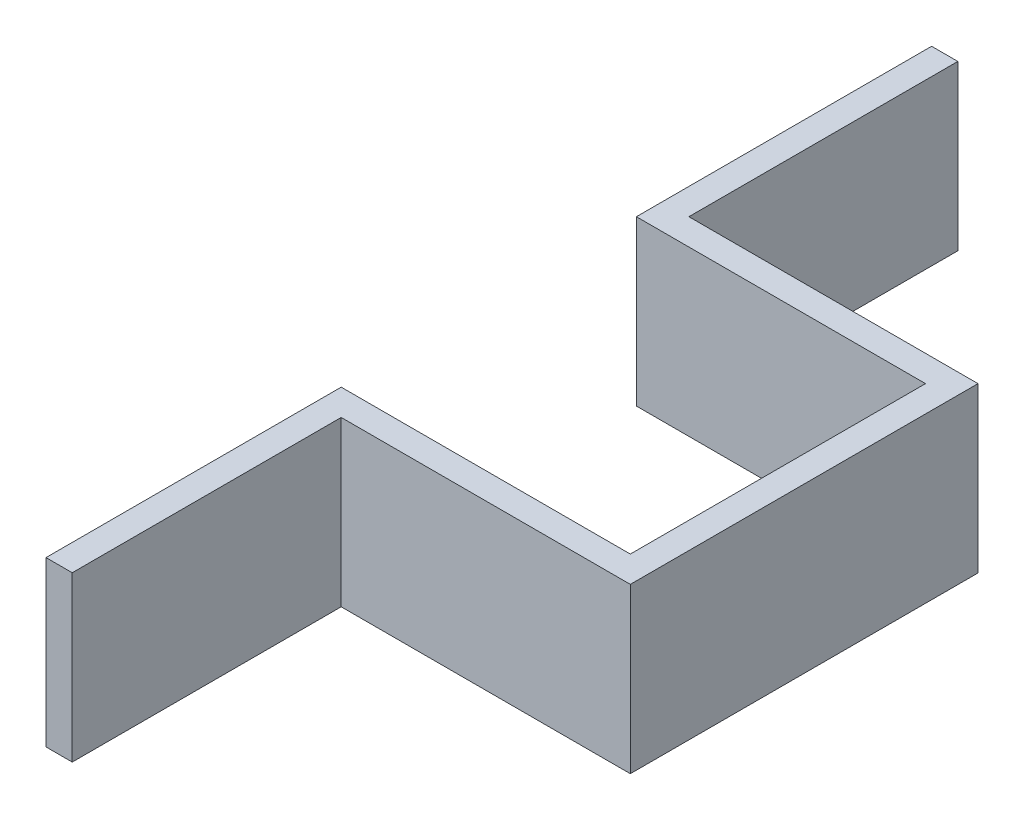
ISO-10303-21;
HEADER;
FILE_DESCRIPTION(('STEP AP214'),'2;1');
FILE_NAME('part.step','',(''),(''),'','','');
FILE_SCHEMA(('AUTOMOTIVE_DESIGN { 1 0 10303 214 1 1 1 1 }'));
ENDSEC;
DATA;
#1=APPLICATION_CONTEXT('core data for automotive mechanical design processes');
#2=APPLICATION_PROTOCOL_DEFINITION('international standard','automotive_design',2000,#1);
#3=PRODUCT_CONTEXT('',#1,'mechanical');
#4=PRODUCT('Part','Part','',(#3));
#5=PRODUCT_RELATED_PRODUCT_CATEGORY('part','',(#4));
#6=PRODUCT_DEFINITION_FORMATION('','',#4);
#7=PRODUCT_DEFINITION_CONTEXT('part definition',#1,'design');
#8=PRODUCT_DEFINITION('design','',#6,#7);
#9=PRODUCT_DEFINITION_SHAPE('','',#8);
#10=(LENGTH_UNIT() NAMED_UNIT(*) SI_UNIT(.MILLI.,.METRE.));
#11=(NAMED_UNIT(*) PLANE_ANGLE_UNIT() SI_UNIT($,.RADIAN.));
#12=(NAMED_UNIT(*) SI_UNIT($,.STERADIAN.) SOLID_ANGLE_UNIT());
#13=UNCERTAINTY_MEASURE_WITH_UNIT(LENGTH_MEASURE(1.E-05),#10,'distance_accuracy_value','');
#14=(GEOMETRIC_REPRESENTATION_CONTEXT(3) GLOBAL_UNCERTAINTY_ASSIGNED_CONTEXT((#13)) GLOBAL_UNIT_ASSIGNED_CONTEXT((#10,
#11,#12)) REPRESENTATION_CONTEXT('',''));
#15=CARTESIAN_POINT('',(0.,0.,0.));
#16=DIRECTION('',(0.,0.,1.));
#17=DIRECTION('',(1.,0.,0.));
#18=AXIS2_PLACEMENT_3D('',#15,#16,#17);
#19=CARTESIAN_POINT('',(194.102258894867,-20.,-261.5));
#20=DIRECTION('',(1.,0.,0.));
#21=DIRECTION('',(0.,0.,-1.));
#22=AXIS2_PLACEMENT_3D('',#19,#20,#21);
#23=PLANE('',#22);
#24=DIRECTION('',(0.,0.,-1.));
#25=VECTOR('',#24,1.);
#26=CARTESIAN_POINT('',(194.102258894867,5.,-261.5));
#27=LINE('',#26,#25);
#28=CARTESIAN_POINT('',(194.102258894867,5.,-261.5));
#29=VERTEX_POINT('',#28);
#30=CARTESIAN_POINT('',(194.102258894867,5.,-302.5));
#31=VERTEX_POINT('',#30);
#32=EDGE_CURVE('E154',#29,#31,#27,.T.);
#33=ORIENTED_EDGE('',*,*,#32,.F.);
#34=DIRECTION('',(0.,1.,0.));
#35=VECTOR('',#34,1.);
#36=CARTESIAN_POINT('',(194.102258894867,-20.,-261.5));
#37=LINE('',#36,#35);
#38=CARTESIAN_POINT('',(194.102258894867,-20.,-261.5));
#39=VERTEX_POINT('',#38);
#40=EDGE_CURVE('E11',#39,#29,#37,.T.);
#41=ORIENTED_EDGE('',*,*,#40,.F.);
#42=DIRECTION('',(0.,0.,-1.));
#43=VECTOR('',#42,1.);
#44=CARTESIAN_POINT('',(194.102258894867,-20.,-261.5));
#45=LINE('',#44,#43);
#46=CARTESIAN_POINT('',(194.102258894867,-20.,-302.5));
#47=VERTEX_POINT('',#46);
#48=EDGE_CURVE('E186',#39,#47,#45,.T.);
#49=ORIENTED_EDGE('',*,*,#48,.T.);
#50=DIRECTION('',(0.,1.,0.));
#51=VECTOR('',#50,1.);
#52=CARTESIAN_POINT('',(194.102258894867,-20.,-302.5));
#53=LINE('',#52,#51);
#54=EDGE_CURVE('E36',#47,#31,#53,.T.);
#55=ORIENTED_EDGE('',*,*,#54,.T.);
#56=EDGE_LOOP('',(#33,#41,#49,#55));
#57=FACE_BOUND('',#56,.T.);
#58=ADVANCED_FACE('F33',(#57),#23,.T.);
#59=CARTESIAN_POINT('',(238.174494692057,-20.,-261.5));
#60=DIRECTION('',(0.,0.,-1.));
#61=DIRECTION('',(-1.,0.,0.));
#62=AXIS2_PLACEMENT_3D('',#59,#60,#61);
#63=PLANE('',#62);
#64=DIRECTION('',(-1.,0.,0.));
#65=VECTOR('',#64,1.);
#66=CARTESIAN_POINT('',(238.174494692057,5.,-261.5));
#67=LINE('',#66,#65);
#68=CARTESIAN_POINT('',(238.174494692057,5.,-261.5));
#69=VERTEX_POINT('',#68);
#70=EDGE_CURVE('E184',#69,#29,#67,.T.);
#71=ORIENTED_EDGE('',*,*,#70,.F.);
#72=DIRECTION('',(0.,1.,0.));
#73=VECTOR('',#72,1.);
#74=CARTESIAN_POINT('',(238.174494692057,-20.,-261.5));
#75=LINE('',#74,#73);
#76=CARTESIAN_POINT('',(238.174494692057,-20.,-261.5));
#77=VERTEX_POINT('',#76);
#78=EDGE_CURVE('E42',#77,#69,#75,.T.);
#79=ORIENTED_EDGE('',*,*,#78,.F.);
#80=DIRECTION('',(-1.,0.,0.));
#81=VECTOR('',#80,1.);
#82=CARTESIAN_POINT('',(238.174494692057,-20.,-261.5));
#83=LINE('',#82,#81);
#84=EDGE_CURVE('E144',#77,#39,#83,.T.);
#85=ORIENTED_EDGE('',*,*,#84,.T.);
#86=ORIENTED_EDGE('',*,*,#40,.T.);
#87=EDGE_LOOP('',(#71,#79,#85,#86));
#88=FACE_BOUND('',#87,.T.);
#89=ADVANCED_FACE('F206',(#88),#63,.T.);
#90=CARTESIAN_POINT('',(238.174494692057,-20.,-208.5));
#91=DIRECTION('',(1.,0.,0.));
#92=DIRECTION('',(0.,0.,-1.));
#93=AXIS2_PLACEMENT_3D('',#90,#91,#92);
#94=PLANE('',#93);
#95=DIRECTION('',(0.,0.,-1.));
#96=VECTOR('',#95,1.);
#97=CARTESIAN_POINT('',(238.174494692057,5.,-208.5));
#98=LINE('',#97,#96);
#99=CARTESIAN_POINT('',(238.174494692057,5.,-208.5));
#100=VERTEX_POINT('',#99);
#101=EDGE_CURVE('E131',#100,#69,#98,.T.);
#102=ORIENTED_EDGE('',*,*,#101,.F.);
#103=DIRECTION('',(0.,1.,0.));
#104=VECTOR('',#103,1.);
#105=CARTESIAN_POINT('',(238.174494692057,-20.,-208.5));
#106=LINE('',#105,#104);
#107=CARTESIAN_POINT('',(238.174494692057,-20.,-208.5));
#108=VERTEX_POINT('',#107);
#109=EDGE_CURVE('E126',#108,#100,#106,.T.);
#110=ORIENTED_EDGE('',*,*,#109,.F.);
#111=DIRECTION('',(0.,0.,-1.));
#112=VECTOR('',#111,1.);
#113=CARTESIAN_POINT('',(238.174494692057,-20.,-208.5));
#114=LINE('',#113,#112);
#115=EDGE_CURVE('E129',#108,#77,#114,.T.);
#116=ORIENTED_EDGE('',*,*,#115,.T.);
#117=ORIENTED_EDGE('',*,*,#78,.T.);
#118=EDGE_LOOP('',(#102,#110,#116,#117));
#119=FACE_BOUND('',#118,.T.);
#120=ADVANCED_FACE('F128',(#119),#94,.T.);
#121=CARTESIAN_POINT('',(194.102258894867,-20.,-208.5));
#122=DIRECTION('',(0.,0.,1.));
#123=DIRECTION('',(1.,0.,0.));
#124=AXIS2_PLACEMENT_3D('',#121,#122,#123);
#125=PLANE('',#124);
#126=DIRECTION('',(1.,0.,0.));
#127=VECTOR('',#126,1.);
#128=CARTESIAN_POINT('',(194.102258894867,5.,-208.5));
#129=LINE('',#128,#127);
#130=CARTESIAN_POINT('',(194.102258894867,5.,-208.5));
#131=VERTEX_POINT('',#130);
#132=EDGE_CURVE('E181',#131,#100,#129,.T.);
#133=ORIENTED_EDGE('',*,*,#132,.F.);
#134=DIRECTION('',(0.,1.,0.));
#135=VECTOR('',#134,1.);
#136=CARTESIAN_POINT('',(194.102258894867,-20.,-208.5));
#137=LINE('',#136,#135);
#138=CARTESIAN_POINT('',(194.102258894867,-20.,-208.5));
#139=VERTEX_POINT('',#138);
#140=EDGE_CURVE('E136',#139,#131,#137,.T.);
#141=ORIENTED_EDGE('',*,*,#140,.F.);
#142=DIRECTION('',(1.,0.,0.));
#143=VECTOR('',#142,1.);
#144=CARTESIAN_POINT('',(194.102258894867,-20.,-208.5));
#145=LINE('',#144,#143);
#146=EDGE_CURVE('E142',#139,#108,#145,.T.);
#147=ORIENTED_EDGE('',*,*,#146,.T.);
#148=ORIENTED_EDGE('',*,*,#109,.T.);
#149=EDGE_LOOP('',(#133,#141,#147,#148));
#150=FACE_BOUND('',#149,.T.);
#151=ADVANCED_FACE('F146',(#150),#125,.T.);
#152=CARTESIAN_POINT('',(194.102258894867,-20.,-167.5));
#153=DIRECTION('',(1.,0.,0.));
#154=DIRECTION('',(0.,0.,-1.));
#155=AXIS2_PLACEMENT_3D('',#152,#153,#154);
#156=PLANE('',#155);
#157=DIRECTION('',(0.,0.,-1.));
#158=VECTOR('',#157,1.);
#159=CARTESIAN_POINT('',(194.102258894867,5.,-167.5));
#160=LINE('',#159,#158);
#161=CARTESIAN_POINT('',(194.102258894867,5.,-167.5));
#162=VERTEX_POINT('',#161);
#163=EDGE_CURVE('E178',#162,#131,#160,.T.);
#164=ORIENTED_EDGE('',*,*,#163,.F.);
#165=DIRECTION('',(0.,1.,0.));
#166=VECTOR('',#165,1.);
#167=CARTESIAN_POINT('',(194.102258894867,-20.,-167.5));
#168=LINE('',#167,#166);
#169=CARTESIAN_POINT('',(194.102258894867,-20.,-167.5));
#170=VERTEX_POINT('',#169);
#171=EDGE_CURVE('E190',#170,#162,#168,.T.);
#172=ORIENTED_EDGE('',*,*,#171,.F.);
#173=DIRECTION('',(0.,0.,-1.));
#174=VECTOR('',#173,1.);
#175=CARTESIAN_POINT('',(194.102258894867,-20.,-167.5));
#176=LINE('',#175,#174);
#177=EDGE_CURVE('E147',#170,#139,#176,.T.);
#178=ORIENTED_EDGE('',*,*,#177,.T.);
#179=ORIENTED_EDGE('',*,*,#140,.T.);
#180=EDGE_LOOP('',(#164,#172,#178,#179));
#181=FACE_BOUND('',#180,.T.);
#182=ADVANCED_FACE('F219',(#181),#156,.T.);
#183=CARTESIAN_POINT('',(190.102258894867,-20.,-167.5));
#184=DIRECTION('',(0.,0.,1.));
#185=DIRECTION('',(1.,0.,0.));
#186=AXIS2_PLACEMENT_3D('',#183,#184,#185);
#187=PLANE('',#186);
#188=DIRECTION('',(1.,0.,0.));
#189=VECTOR('',#188,1.);
#190=CARTESIAN_POINT('',(190.102258894867,5.,-167.5));
#191=LINE('',#190,#189);
#192=CARTESIAN_POINT('',(190.102258894867,5.,-167.5));
#193=VERTEX_POINT('',#192);
#194=EDGE_CURVE('E175',#193,#162,#191,.T.);
#195=ORIENTED_EDGE('',*,*,#194,.F.);
#196=DIRECTION('',(0.,1.,0.));
#197=VECTOR('',#196,1.);
#198=CARTESIAN_POINT('',(190.102258894867,-20.,-167.5));
#199=LINE('',#198,#197);
#200=CARTESIAN_POINT('',(190.102258894867,-20.,-167.5));
#201=VERTEX_POINT('',#200);
#202=EDGE_CURVE('E192',#201,#193,#199,.T.);
#203=ORIENTED_EDGE('',*,*,#202,.F.);
#204=DIRECTION('',(1.,0.,0.));
#205=VECTOR('',#204,1.);
#206=CARTESIAN_POINT('',(190.102258894867,-20.,-167.5));
#207=LINE('',#206,#205);
#208=EDGE_CURVE('E149',#201,#170,#207,.T.);
#209=ORIENTED_EDGE('',*,*,#208,.T.);
#210=ORIENTED_EDGE('',*,*,#171,.T.);
#211=EDGE_LOOP('',(#195,#203,#209,#210));
#212=FACE_BOUND('',#211,.T.);
#213=ADVANCED_FACE('F222',(#212),#187,.T.);
#214=CARTESIAN_POINT('',(190.102258894867,-20.,-212.5));
#215=DIRECTION('',(-1.,0.,0.));
#216=DIRECTION('',(0.,0.,1.));
#217=AXIS2_PLACEMENT_3D('',#214,#215,#216);
#218=PLANE('',#217);
#219=DIRECTION('',(0.,0.,1.));
#220=VECTOR('',#219,1.);
#221=CARTESIAN_POINT('',(190.102258894867,5.,-212.5));
#222=LINE('',#221,#220);
#223=CARTESIAN_POINT('',(190.102258894867,5.,-212.5));
#224=VERTEX_POINT('',#223);
#225=EDGE_CURVE('E172',#224,#193,#222,.T.);
#226=ORIENTED_EDGE('',*,*,#225,.F.);
#227=DIRECTION('',(0.,1.,0.));
#228=VECTOR('',#227,1.);
#229=CARTESIAN_POINT('',(190.102258894867,-20.,-212.5));
#230=LINE('',#229,#228);
#231=CARTESIAN_POINT('',(190.102258894867,-20.,-212.5));
#232=VERTEX_POINT('',#231);
#233=EDGE_CURVE('E194',#232,#224,#230,.T.);
#234=ORIENTED_EDGE('',*,*,#233,.F.);
#235=DIRECTION('',(0.,0.,1.));
#236=VECTOR('',#235,1.);
#237=CARTESIAN_POINT('',(190.102258894867,-20.,-212.5));
#238=LINE('',#237,#236);
#239=EDGE_CURVE('E348',#232,#201,#238,.T.);
#240=ORIENTED_EDGE('',*,*,#239,.T.);
#241=ORIENTED_EDGE('',*,*,#202,.T.);
#242=EDGE_LOOP('',(#226,#234,#240,#241));
#243=FACE_BOUND('',#242,.T.);
#244=ADVANCED_FACE('F226',(#243),#218,.T.);
#245=CARTESIAN_POINT('',(234.174494692057,-20.,-212.5));
#246=DIRECTION('',(0.,0.,-1.));
#247=DIRECTION('',(-1.,0.,0.));
#248=AXIS2_PLACEMENT_3D('',#245,#246,#247);
#249=PLANE('',#248);
#250=DIRECTION('',(-1.,0.,0.));
#251=VECTOR('',#250,1.);
#252=CARTESIAN_POINT('',(234.174494692057,5.,-212.5));
#253=LINE('',#252,#251);
#254=CARTESIAN_POINT('',(234.174494692057,5.,-212.5));
#255=VERTEX_POINT('',#254);
#256=EDGE_CURVE('E169',#255,#224,#253,.T.);
#257=ORIENTED_EDGE('',*,*,#256,.F.);
#258=DIRECTION('',(0.,1.,0.));
#259=VECTOR('',#258,1.);
#260=CARTESIAN_POINT('',(234.174494692057,-20.,-212.5));
#261=LINE('',#260,#259);
#262=CARTESIAN_POINT('',(234.174494692057,-20.,-212.5));
#263=VERTEX_POINT('',#262);
#264=EDGE_CURVE('E196',#263,#255,#261,.T.);
#265=ORIENTED_EDGE('',*,*,#264,.F.);
#266=DIRECTION('',(-1.,0.,0.));
#267=VECTOR('',#266,1.);
#268=CARTESIAN_POINT('',(234.174494692057,-20.,-212.5));
#269=LINE('',#268,#267);
#270=EDGE_CURVE('E352',#263,#232,#269,.T.);
#271=ORIENTED_EDGE('',*,*,#270,.T.);
#272=ORIENTED_EDGE('',*,*,#233,.T.);
#273=EDGE_LOOP('',(#257,#265,#271,#272));
#274=FACE_BOUND('',#273,.T.);
#275=ADVANCED_FACE('F230',(#274),#249,.T.);
#276=CARTESIAN_POINT('',(234.174494692057,-20.,-257.5));
#277=DIRECTION('',(-1.,0.,0.));
#278=DIRECTION('',(0.,0.,1.));
#279=AXIS2_PLACEMENT_3D('',#276,#277,#278);
#280=PLANE('',#279);
#281=DIRECTION('',(0.,0.,1.));
#282=VECTOR('',#281,1.);
#283=CARTESIAN_POINT('',(234.174494692057,5.,-257.5));
#284=LINE('',#283,#282);
#285=CARTESIAN_POINT('',(234.174494692057,5.,-257.5));
#286=VERTEX_POINT('',#285);
#287=EDGE_CURVE('E166',#286,#255,#284,.T.);
#288=ORIENTED_EDGE('',*,*,#287,.F.);
#289=DIRECTION('',(0.,1.,0.));
#290=VECTOR('',#289,1.);
#291=CARTESIAN_POINT('',(234.174494692057,-20.,-257.5));
#292=LINE('',#291,#290);
#293=CARTESIAN_POINT('',(234.174494692057,-20.,-257.5));
#294=VERTEX_POINT('',#293);
#295=EDGE_CURVE('E198',#294,#286,#292,.T.);
#296=ORIENTED_EDGE('',*,*,#295,.F.);
#297=DIRECTION('',(0.,0.,1.));
#298=VECTOR('',#297,1.);
#299=CARTESIAN_POINT('',(234.174494692057,-20.,-257.5));
#300=LINE('',#299,#298);
#301=EDGE_CURVE('E341',#294,#263,#300,.T.);
#302=ORIENTED_EDGE('',*,*,#301,.T.);
#303=ORIENTED_EDGE('',*,*,#264,.T.);
#304=EDGE_LOOP('',(#288,#296,#302,#303));
#305=FACE_BOUND('',#304,.T.);
#306=ADVANCED_FACE('F234',(#305),#280,.T.);
#307=CARTESIAN_POINT('',(190.102258894867,-20.,-257.5));
#308=DIRECTION('',(0.,0.,1.));
#309=DIRECTION('',(1.,0.,0.));
#310=AXIS2_PLACEMENT_3D('',#307,#308,#309);
#311=PLANE('',#310);
#312=DIRECTION('',(1.,0.,0.));
#313=VECTOR('',#312,1.);
#314=CARTESIAN_POINT('',(190.102258894867,5.,-257.5));
#315=LINE('',#314,#313);
#316=CARTESIAN_POINT('',(190.102258894867,5.,-257.5));
#317=VERTEX_POINT('',#316);
#318=EDGE_CURVE('E163',#317,#286,#315,.T.);
#319=ORIENTED_EDGE('',*,*,#318,.F.);
#320=DIRECTION('',(0.,1.,0.));
#321=VECTOR('',#320,1.);
#322=CARTESIAN_POINT('',(190.102258894867,-20.,-257.5));
#323=LINE('',#322,#321);
#324=CARTESIAN_POINT('',(190.102258894867,-20.,-257.5));
#325=VERTEX_POINT('',#324);
#326=EDGE_CURVE('E200',#325,#317,#323,.T.);
#327=ORIENTED_EDGE('',*,*,#326,.F.);
#328=DIRECTION('',(1.,0.,0.));
#329=VECTOR('',#328,1.);
#330=CARTESIAN_POINT('',(190.102258894867,-20.,-257.5));
#331=LINE('',#330,#329);
#332=EDGE_CURVE('E337',#325,#294,#331,.T.);
#333=ORIENTED_EDGE('',*,*,#332,.T.);
#334=ORIENTED_EDGE('',*,*,#295,.T.);
#335=EDGE_LOOP('',(#319,#327,#333,#334));
#336=FACE_BOUND('',#335,.T.);
#337=ADVANCED_FACE('F238',(#336),#311,.T.);
#338=CARTESIAN_POINT('',(190.102258894867,-20.,-302.5));
#339=DIRECTION('',(-1.,0.,0.));
#340=DIRECTION('',(0.,0.,1.));
#341=AXIS2_PLACEMENT_3D('',#338,#339,#340);
#342=PLANE('',#341);
#343=DIRECTION('',(0.,0.,1.));
#344=VECTOR('',#343,1.);
#345=CARTESIAN_POINT('',(190.102258894867,5.,-302.5));
#346=LINE('',#345,#344);
#347=CARTESIAN_POINT('',(190.102258894867,5.,-302.5));
#348=VERTEX_POINT('',#347);
#349=EDGE_CURVE('E160',#348,#317,#346,.T.);
#350=ORIENTED_EDGE('',*,*,#349,.F.);
#351=DIRECTION('',(0.,1.,0.));
#352=VECTOR('',#351,1.);
#353=CARTESIAN_POINT('',(190.102258894867,-20.,-302.5));
#354=LINE('',#353,#352);
#355=CARTESIAN_POINT('',(190.102258894867,-20.,-302.5));
#356=VERTEX_POINT('',#355);
#357=EDGE_CURVE('E201',#356,#348,#354,.T.);
#358=ORIENTED_EDGE('',*,*,#357,.F.);
#359=DIRECTION('',(0.,0.,1.));
#360=VECTOR('',#359,1.);
#361=CARTESIAN_POINT('',(190.102258894867,-20.,-302.5));
#362=LINE('',#361,#360);
#363=EDGE_CURVE('E358',#356,#325,#362,.T.);
#364=ORIENTED_EDGE('',*,*,#363,.T.);
#365=ORIENTED_EDGE('',*,*,#326,.T.);
#366=EDGE_LOOP('',(#350,#358,#364,#365));
#367=FACE_BOUND('',#366,.T.);
#368=ADVANCED_FACE('F242',(#367),#342,.T.);
#369=CARTESIAN_POINT('',(194.102258894867,-20.,-302.5));
#370=DIRECTION('',(0.,0.,-1.));
#371=DIRECTION('',(-1.,0.,0.));
#372=AXIS2_PLACEMENT_3D('',#369,#370,#371);
#373=PLANE('',#372);
#374=DIRECTION('',(-1.,0.,0.));
#375=VECTOR('',#374,1.);
#376=CARTESIAN_POINT('',(194.102258894867,5.,-302.5));
#377=LINE('',#376,#375);
#378=EDGE_CURVE('E157',#31,#348,#377,.T.);
#379=ORIENTED_EDGE('',*,*,#378,.F.);
#380=ORIENTED_EDGE('',*,*,#54,.F.);
#381=DIRECTION('',(-1.,0.,0.));
#382=VECTOR('',#381,1.);
#383=CARTESIAN_POINT('',(194.102258894867,-20.,-302.5));
#384=LINE('',#383,#382);
#385=EDGE_CURVE('E360',#47,#356,#384,.T.);
#386=ORIENTED_EDGE('',*,*,#385,.T.);
#387=ORIENTED_EDGE('',*,*,#357,.T.);
#388=EDGE_LOOP('',(#379,#380,#386,#387));
#389=FACE_BOUND('',#388,.T.);
#390=ADVANCED_FACE('F203',(#389),#373,.T.);
#391=CARTESIAN_POINT('',(0.,-20.,0.));
#392=DIRECTION('',(0.,1.,0.));
#393=DIRECTION('',(0.,0.,1.));
#394=AXIS2_PLACEMENT_3D('',#391,#392,#393);
#395=PLANE('',#394);
#396=ORIENTED_EDGE('',*,*,#48,.F.);
#397=ORIENTED_EDGE('',*,*,#84,.F.);
#398=ORIENTED_EDGE('',*,*,#115,.F.);
#399=ORIENTED_EDGE('',*,*,#146,.F.);
#400=ORIENTED_EDGE('',*,*,#177,.F.);
#401=ORIENTED_EDGE('',*,*,#208,.F.);
#402=ORIENTED_EDGE('',*,*,#239,.F.);
#403=ORIENTED_EDGE('',*,*,#270,.F.);
#404=ORIENTED_EDGE('',*,*,#301,.F.);
#405=ORIENTED_EDGE('',*,*,#332,.F.);
#406=ORIENTED_EDGE('',*,*,#363,.F.);
#407=ORIENTED_EDGE('',*,*,#385,.F.);
#408=EDGE_LOOP('',(#396,#397,#398,#399,#400,#401,#402,#403,#404,#405,#406,#407));
#409=FACE_BOUND('',#408,.T.);
#410=ADVANCED_FACE('F140',(#409),#395,.F.);
#411=CARTESIAN_POINT('',(0.,5.,0.));
#412=DIRECTION('',(0.,1.,0.));
#413=DIRECTION('',(0.,0.,1.));
#414=AXIS2_PLACEMENT_3D('',#411,#412,#413);
#415=PLANE('',#414);
#416=ORIENTED_EDGE('',*,*,#32,.T.);
#417=ORIENTED_EDGE('',*,*,#378,.T.);
#418=ORIENTED_EDGE('',*,*,#349,.T.);
#419=ORIENTED_EDGE('',*,*,#318,.T.);
#420=ORIENTED_EDGE('',*,*,#287,.T.);
#421=ORIENTED_EDGE('',*,*,#256,.T.);
#422=ORIENTED_EDGE('',*,*,#225,.T.);
#423=ORIENTED_EDGE('',*,*,#194,.T.);
#424=ORIENTED_EDGE('',*,*,#163,.T.);
#425=ORIENTED_EDGE('',*,*,#132,.T.);
#426=ORIENTED_EDGE('',*,*,#101,.T.);
#427=ORIENTED_EDGE('',*,*,#70,.T.);
#428=EDGE_LOOP('',(#416,#417,#418,#419,#420,#421,#422,#423,#424,#425,#426,#427));
#429=FACE_BOUND('',#428,.T.);
#430=ADVANCED_FACE('F205',(#429),#415,.T.);
#431=CLOSED_SHELL('',(#58,#89,#120,#151,#182,#213,#244,#275,#306,#337,#368,#390,#410,#430));
#432=MANIFOLD_SOLID_BREP('B2',#431);
#433=ADVANCED_BREP_SHAPE_REPRESENTATION('',(#18,#432),#14);
#434=SHAPE_DEFINITION_REPRESENTATION(#9,#433);
ENDSEC;
END-ISO-10303-21;
